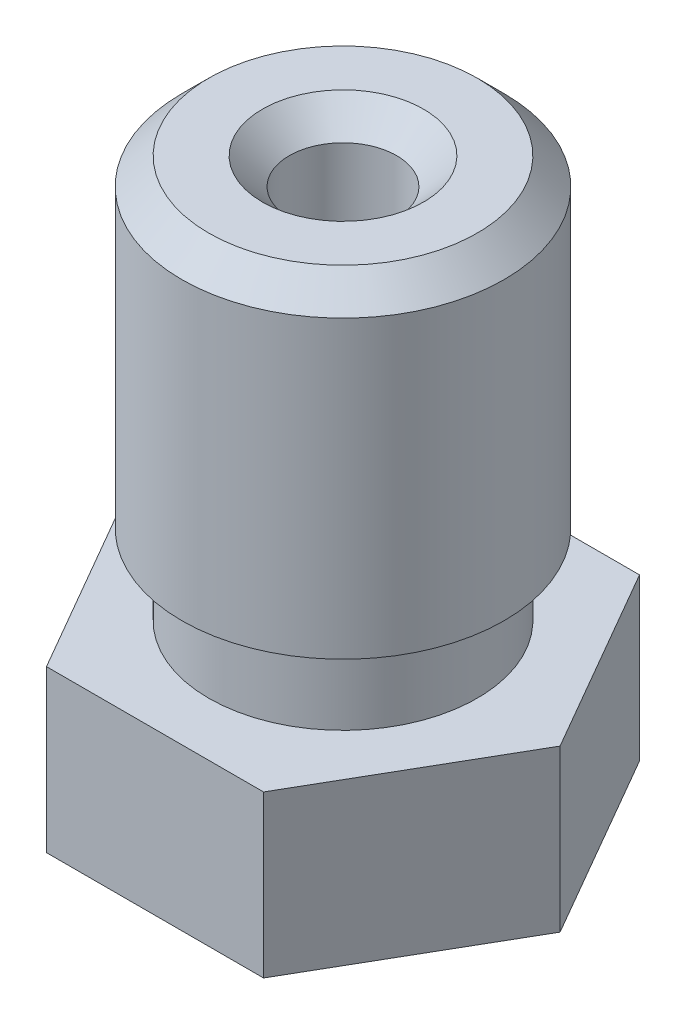
ISO-10303-21;
HEADER;
FILE_DESCRIPTION(('STEP AP214'),'2;1');
FILE_NAME('part.step','',(''),(''),'','','');
FILE_SCHEMA(('AUTOMOTIVE_DESIGN { 1 0 10303 214 1 1 1 1 }'));
ENDSEC;
DATA;
#1=APPLICATION_CONTEXT('core data for automotive mechanical design processes');
#2=APPLICATION_PROTOCOL_DEFINITION('international standard','automotive_design',2000,#1);
#3=PRODUCT_CONTEXT('',#1,'mechanical');
#4=PRODUCT('Part','Part','',(#3));
#5=PRODUCT_RELATED_PRODUCT_CATEGORY('part','',(#4));
#6=PRODUCT_DEFINITION_FORMATION('','',#4);
#7=PRODUCT_DEFINITION_CONTEXT('part definition',#1,'design');
#8=PRODUCT_DEFINITION('design','',#6,#7);
#9=PRODUCT_DEFINITION_SHAPE('','',#8);
#10=(LENGTH_UNIT() NAMED_UNIT(*) SI_UNIT(.MILLI.,.METRE.));
#11=(NAMED_UNIT(*) PLANE_ANGLE_UNIT() SI_UNIT($,.RADIAN.));
#12=(NAMED_UNIT(*) SI_UNIT($,.STERADIAN.) SOLID_ANGLE_UNIT());
#13=UNCERTAINTY_MEASURE_WITH_UNIT(LENGTH_MEASURE(1.E-05),#10,'distance_accuracy_value','');
#14=(GEOMETRIC_REPRESENTATION_CONTEXT(3) GLOBAL_UNCERTAINTY_ASSIGNED_CONTEXT((#13)) GLOBAL_UNIT_ASSIGNED_CONTEXT((#10,
#11,#12)) REPRESENTATION_CONTEXT('',''));
#15=CARTESIAN_POINT('',(0.,0.,0.));
#16=DIRECTION('',(0.,0.,1.));
#17=DIRECTION('',(1.,0.,0.));
#18=AXIS2_PLACEMENT_3D('',#15,#16,#17);
#19=CARTESIAN_POINT('',(-2.02072594216369,3.,-3.5));
#20=DIRECTION('',(0.,0.,-1.));
#21=DIRECTION('',(-1.,0.,0.));
#22=AXIS2_PLACEMENT_3D('',#19,#20,#21);
#23=PLANE('',#22);
#24=DIRECTION('',(1.,0.,0.));
#25=VECTOR('',#24,1.);
#26=CARTESIAN_POINT('',(-2.02072594216369,0.,-3.5));
#27=LINE('',#26,#25);
#28=CARTESIAN_POINT('',(-2.02072594216369,0.,-3.5));
#29=VERTEX_POINT('',#28);
#30=CARTESIAN_POINT('',(2.02072594216369,0.,-3.5));
#31=VERTEX_POINT('',#30);
#32=EDGE_CURVE('E120',#29,#31,#27,.T.);
#33=ORIENTED_EDGE('',*,*,#32,.F.);
#34=DIRECTION('',(0.,-1.,0.));
#35=VECTOR('',#34,1.);
#36=CARTESIAN_POINT('',(-2.02072594216369,3.,-3.5));
#37=LINE('',#36,#35);
#38=CARTESIAN_POINT('',(-2.02072594216369,3.,-3.5));
#39=VERTEX_POINT('',#38);
#40=EDGE_CURVE('E49',#39,#29,#37,.T.);
#41=ORIENTED_EDGE('',*,*,#40,.F.);
#42=DIRECTION('',(1.,0.,0.));
#43=VECTOR('',#42,1.);
#44=CARTESIAN_POINT('',(-2.02072594216369,3.,-3.5));
#45=LINE('',#44,#43);
#46=CARTESIAN_POINT('',(2.02072594216369,3.,-3.5));
#47=VERTEX_POINT('',#46);
#48=EDGE_CURVE('E136',#39,#47,#45,.T.);
#49=ORIENTED_EDGE('',*,*,#48,.T.);
#50=DIRECTION('',(0.,-1.,0.));
#51=VECTOR('',#50,1.);
#52=CARTESIAN_POINT('',(2.02072594216369,3.,-3.5));
#53=LINE('',#52,#51);
#54=EDGE_CURVE('E84',#47,#31,#53,.T.);
#55=ORIENTED_EDGE('',*,*,#54,.T.);
#56=EDGE_LOOP('',(#33,#41,#49,#55));
#57=FACE_BOUND('',#56,.T.);
#58=ADVANCED_FACE('F32',(#57),#23,.T.);
#59=CARTESIAN_POINT('',(-4.04145188432738,3.,0.));
#60=DIRECTION('',(-0.866025403784439,0.,-0.5));
#61=DIRECTION('',(-0.5,0.,0.866025403784439));
#62=AXIS2_PLACEMENT_3D('',#59,#60,#61);
#63=PLANE('',#62);
#64=DIRECTION('',(0.5,0.,-0.866025403784439));
#65=VECTOR('',#64,1.);
#66=CARTESIAN_POINT('',(-4.04145188432738,0.,0.));
#67=LINE('',#66,#65);
#68=CARTESIAN_POINT('',(-4.04145188432738,0.,0.));
#69=VERTEX_POINT('',#68);
#70=EDGE_CURVE('E133',#69,#29,#67,.T.);
#71=ORIENTED_EDGE('',*,*,#70,.F.);
#72=DIRECTION('',(0.,-1.,0.));
#73=VECTOR('',#72,1.);
#74=CARTESIAN_POINT('',(-4.04145188432738,3.,0.));
#75=LINE('',#74,#73);
#76=CARTESIAN_POINT('',(-4.04145188432738,3.,0.));
#77=VERTEX_POINT('',#76);
#78=EDGE_CURVE('E72',#77,#69,#75,.T.);
#79=ORIENTED_EDGE('',*,*,#78,.F.);
#80=DIRECTION('',(0.5,0.,-0.866025403784439));
#81=VECTOR('',#80,1.);
#82=CARTESIAN_POINT('',(-4.04145188432738,3.,0.));
#83=LINE('',#82,#81);
#84=EDGE_CURVE('E110',#77,#39,#83,.T.);
#85=ORIENTED_EDGE('',*,*,#84,.T.);
#86=ORIENTED_EDGE('',*,*,#40,.T.);
#87=EDGE_LOOP('',(#71,#79,#85,#86));
#88=FACE_BOUND('',#87,.T.);
#89=ADVANCED_FACE('F209',(#88),#63,.T.);
#90=CARTESIAN_POINT('',(-2.02072594216369,3.,3.5));
#91=DIRECTION('',(-0.866025403784439,0.,0.5));
#92=DIRECTION('',(0.5,0.,0.866025403784439));
#93=AXIS2_PLACEMENT_3D('',#90,#91,#92);
#94=PLANE('',#93);
#95=DIRECTION('',(-0.5,0.,-0.866025403784438));
#96=VECTOR('',#95,1.);
#97=CARTESIAN_POINT('',(-2.02072594216369,0.,3.5));
#98=LINE('',#97,#96);
#99=CARTESIAN_POINT('',(-2.02072594216369,0.,3.5));
#100=VERTEX_POINT('',#99);
#101=EDGE_CURVE('E97',#100,#69,#98,.T.);
#102=ORIENTED_EDGE('',*,*,#101,.F.);
#103=DIRECTION('',(0.,-1.,0.));
#104=VECTOR('',#103,1.);
#105=CARTESIAN_POINT('',(-2.02072594216369,3.,3.5));
#106=LINE('',#105,#104);
#107=CARTESIAN_POINT('',(-2.02072594216369,3.,3.5));
#108=VERTEX_POINT('',#107);
#109=EDGE_CURVE('E92',#108,#100,#106,.T.);
#110=ORIENTED_EDGE('',*,*,#109,.F.);
#111=DIRECTION('',(-0.5,0.,-0.866025403784438));
#112=VECTOR('',#111,1.);
#113=CARTESIAN_POINT('',(-2.02072594216369,3.,3.5));
#114=LINE('',#113,#112);
#115=EDGE_CURVE('E95',#108,#77,#114,.T.);
#116=ORIENTED_EDGE('',*,*,#115,.T.);
#117=ORIENTED_EDGE('',*,*,#78,.T.);
#118=EDGE_LOOP('',(#102,#110,#116,#117));
#119=FACE_BOUND('',#118,.T.);
#120=ADVANCED_FACE('F94',(#119),#94,.T.);
#121=CARTESIAN_POINT('',(2.02072594216369,3.,3.5));
#122=DIRECTION('',(0.,0.,1.));
#123=DIRECTION('',(1.,0.,0.));
#124=AXIS2_PLACEMENT_3D('',#121,#122,#123);
#125=PLANE('',#124);
#126=DIRECTION('',(-1.,0.,0.));
#127=VECTOR('',#126,1.);
#128=CARTESIAN_POINT('',(2.02072594216369,0.,3.5));
#129=LINE('',#128,#127);
#130=CARTESIAN_POINT('',(2.02072594216369,0.,3.5));
#131=VERTEX_POINT('',#130);
#132=EDGE_CURVE('E130',#131,#100,#129,.T.);
#133=ORIENTED_EDGE('',*,*,#132,.F.);
#134=DIRECTION('',(0.,-1.,0.));
#135=VECTOR('',#134,1.);
#136=CARTESIAN_POINT('',(2.02072594216369,3.,3.5));
#137=LINE('',#136,#135);
#138=CARTESIAN_POINT('',(2.02072594216369,3.,3.5));
#139=VERTEX_POINT('',#138);
#140=EDGE_CURVE('E102',#139,#131,#137,.T.);
#141=ORIENTED_EDGE('',*,*,#140,.F.);
#142=DIRECTION('',(-1.,0.,0.));
#143=VECTOR('',#142,1.);
#144=CARTESIAN_POINT('',(2.02072594216369,3.,3.5));
#145=LINE('',#144,#143);
#146=EDGE_CURVE('E108',#139,#108,#145,.T.);
#147=ORIENTED_EDGE('',*,*,#146,.T.);
#148=ORIENTED_EDGE('',*,*,#109,.T.);
#149=EDGE_LOOP('',(#133,#141,#147,#148));
#150=FACE_BOUND('',#149,.T.);
#151=ADVANCED_FACE('F112',(#150),#125,.T.);
#152=CARTESIAN_POINT('',(4.04145188432738,3.,0.));
#153=DIRECTION('',(0.866025403784439,0.,0.5));
#154=DIRECTION('',(0.5,0.,-0.866025403784439));
#155=AXIS2_PLACEMENT_3D('',#152,#153,#154);
#156=PLANE('',#155);
#157=DIRECTION('',(-0.5,0.,0.866025403784439));
#158=VECTOR('',#157,1.);
#159=CARTESIAN_POINT('',(4.04145188432738,0.,0.));
#160=LINE('',#159,#158);
#161=CARTESIAN_POINT('',(4.04145188432738,0.,0.));
#162=VERTEX_POINT('',#161);
#163=EDGE_CURVE('E127',#162,#131,#160,.T.);
#164=ORIENTED_EDGE('',*,*,#163,.F.);
#165=DIRECTION('',(0.,-1.,0.));
#166=VECTOR('',#165,1.);
#167=CARTESIAN_POINT('',(4.04145188432738,3.,0.));
#168=LINE('',#167,#166);
#169=CARTESIAN_POINT('',(4.04145188432738,3.,0.));
#170=VERTEX_POINT('',#169);
#171=EDGE_CURVE('E141',#170,#162,#168,.T.);
#172=ORIENTED_EDGE('',*,*,#171,.F.);
#173=DIRECTION('',(-0.5,0.,0.866025403784439));
#174=VECTOR('',#173,1.);
#175=CARTESIAN_POINT('',(4.04145188432738,3.,0.));
#176=LINE('',#175,#174);
#177=EDGE_CURVE('E113',#170,#139,#176,.T.);
#178=ORIENTED_EDGE('',*,*,#177,.T.);
#179=ORIENTED_EDGE('',*,*,#140,.T.);
#180=EDGE_LOOP('',(#164,#172,#178,#179));
#181=FACE_BOUND('',#180,.T.);
#182=ADVANCED_FACE('F223',(#181),#156,.T.);
#183=CARTESIAN_POINT('',(2.02072594216369,3.,-3.5));
#184=DIRECTION('',(0.866025403784439,0.,-0.5));
#185=DIRECTION('',(-0.5,0.,-0.866025403784439));
#186=AXIS2_PLACEMENT_3D('',#183,#184,#185);
#187=PLANE('',#186);
#188=DIRECTION('',(0.5,0.,0.866025403784438));
#189=VECTOR('',#188,1.);
#190=CARTESIAN_POINT('',(2.02072594216369,0.,-3.5));
#191=LINE('',#190,#189);
#192=EDGE_CURVE('E123',#31,#162,#191,.T.);
#193=ORIENTED_EDGE('',*,*,#192,.F.);
#194=ORIENTED_EDGE('',*,*,#54,.F.);
#195=DIRECTION('',(0.5,0.,0.866025403784438));
#196=VECTOR('',#195,1.);
#197=CARTESIAN_POINT('',(2.02072594216369,3.,-3.5));
#198=LINE('',#197,#196);
#199=EDGE_CURVE('E115',#47,#170,#198,.T.);
#200=ORIENTED_EDGE('',*,*,#199,.T.);
#201=ORIENTED_EDGE('',*,*,#171,.T.);
#202=EDGE_LOOP('',(#193,#194,#200,#201));
#203=FACE_BOUND('',#202,.T.);
#204=ADVANCED_FACE('F205',(#203),#187,.T.);
#205=CARTESIAN_POINT('',(0.,3.,0.));
#206=DIRECTION('',(0.,-1.,0.));
#207=DIRECTION('',(0.,0.,-1.));
#208=AXIS2_PLACEMENT_3D('',#205,#206,#207);
#209=PLANE('',#208);
#210=CARTESIAN_POINT('',(0.,3.,0.));
#211=DIRECTION('',(0.,1.,0.));
#212=DIRECTION('',(0.,0.,1.));
#213=AXIS2_PLACEMENT_3D('',#210,#211,#212);
#214=CIRCLE('',#213,2.5);
#215=CARTESIAN_POINT('',(0.,3.,2.5));
#216=VERTEX_POINT('',#215);
#217=EDGE_CURVE('E138',#216,#216,#214,.T.);
#218=ORIENTED_EDGE('',*,*,#217,.F.);
#219=EDGE_LOOP('',(#218));
#220=FACE_BOUND('',#219,.T.);
#221=ORIENTED_EDGE('',*,*,#48,.F.);
#222=ORIENTED_EDGE('',*,*,#84,.F.);
#223=ORIENTED_EDGE('',*,*,#115,.F.);
#224=ORIENTED_EDGE('',*,*,#146,.F.);
#225=ORIENTED_EDGE('',*,*,#177,.F.);
#226=ORIENTED_EDGE('',*,*,#199,.F.);
#227=EDGE_LOOP('',(#221,#222,#223,#224,#225,#226));
#228=FACE_BOUND('',#227,.T.);
#229=ADVANCED_FACE('F106',(#220,#228),#209,.F.);
#230=CARTESIAN_POINT('',(0.,0.,0.));
#231=DIRECTION('',(0.,-1.,0.));
#232=DIRECTION('',(0.,0.,-1.));
#233=AXIS2_PLACEMENT_3D('',#230,#231,#232);
#234=PLANE('',#233);
#235=CARTESIAN_POINT('',(0.,-4.7295228202692E-11,0.));
#236=DIRECTION('',(0.,-1.,0.));
#237=DIRECTION('',(1.,0.,0.));
#238=AXIS2_PLACEMENT_3D('',#235,#236,#237);
#239=CIRCLE('',#238,2.49999999999773);
#240=CARTESIAN_POINT('',(2.49999999999773,-4.72946861016057E-11,0.));
#241=VERTEX_POINT('',#240);
#242=EDGE_CURVE('E148',#241,#241,#239,.T.);
#243=ORIENTED_EDGE('',*,*,#242,.F.);
#244=EDGE_LOOP('',(#243));
#245=FACE_BOUND('',#244,.T.);
#246=ORIENTED_EDGE('',*,*,#32,.T.);
#247=ORIENTED_EDGE('',*,*,#192,.T.);
#248=ORIENTED_EDGE('',*,*,#163,.T.);
#249=ORIENTED_EDGE('',*,*,#132,.T.);
#250=ORIENTED_EDGE('',*,*,#101,.T.);
#251=ORIENTED_EDGE('',*,*,#70,.T.);
#252=EDGE_LOOP('',(#246,#247,#248,#249,#250,#251));
#253=FACE_BOUND('',#252,.T.);
#254=ADVANCED_FACE('F208',(#245,#253),#234,.T.);
#255=CARTESIAN_POINT('',(0.,3.,0.));
#256=DIRECTION('',(0.,1.,0.));
#257=DIRECTION('',(0.,0.,1.));
#258=AXIS2_PLACEMENT_3D('',#255,#256,#257);
#259=CYLINDRICAL_SURFACE('',#258,2.5);
#260=ORIENTED_EDGE('',*,*,#217,.T.);
#261=EDGE_LOOP('',(#260));
#262=FACE_BOUND('',#261,.T.);
#263=CARTESIAN_POINT('',(0.,4.5,0.));
#264=DIRECTION('',(0.,1.,0.));
#265=DIRECTION('',(0.,0.,1.));
#266=AXIS2_PLACEMENT_3D('',#263,#264,#265);
#267=CIRCLE('',#266,2.5);
#268=CARTESIAN_POINT('',(0.,4.5,2.5));
#269=VERTEX_POINT('',#268);
#270=EDGE_CURVE('E196',#269,#269,#267,.T.);
#271=ORIENTED_EDGE('',*,*,#270,.F.);
#272=EDGE_LOOP('',(#271));
#273=FACE_BOUND('',#272,.T.);
#274=ADVANCED_FACE('F165',(#262,#273),#259,.T.);
#275=CARTESIAN_POINT('',(0.,10.5,0.));
#276=DIRECTION('',(0.,1.,0.));
#277=DIRECTION('',(0.,0.,1.));
#278=AXIS2_PLACEMENT_3D('',#275,#276,#277);
#279=PLANE('',#278);
#280=CARTESIAN_POINT('',(0.,10.5,0.));
#281=DIRECTION('',(0.,1.,0.));
#282=DIRECTION('',(0.,0.,1.));
#283=AXIS2_PLACEMENT_3D('',#280,#281,#282);
#284=CIRCLE('',#283,2.49999999995498);
#285=CARTESIAN_POINT('',(0.,10.5,2.49999999995498));
#286=VERTEX_POINT('',#285);
#287=EDGE_CURVE('E147',#286,#286,#284,.T.);
#288=ORIENTED_EDGE('',*,*,#287,.T.);
#289=EDGE_LOOP('',(#288));
#290=FACE_BOUND('',#289,.T.);
#291=CARTESIAN_POINT('',(0.,10.5,0.));
#292=DIRECTION('',(0.,1.,0.));
#293=DIRECTION('',(0.,0.,1.));
#294=AXIS2_PLACEMENT_3D('',#291,#292,#293);
#295=CIRCLE('',#294,1.50000000001028);
#296=CARTESIAN_POINT('',(0.,10.5,1.50000000001028));
#297=VERTEX_POINT('',#296);
#298=EDGE_CURVE('E144',#297,#297,#295,.F.);
#299=ORIENTED_EDGE('',*,*,#298,.T.);
#300=EDGE_LOOP('',(#299));
#301=FACE_BOUND('',#300,.T.);
#302=ADVANCED_FACE('F162',(#290,#301),#279,.T.);
#303=CARTESIAN_POINT('',(0.,3.,0.));
#304=DIRECTION('',(0.,1.,0.));
#305=DIRECTION('',(0.,0.,1.));
#306=AXIS2_PLACEMENT_3D('',#303,#304,#305);
#307=CYLINDRICAL_SURFACE('',#306,3.);
#308=CARTESIAN_POINT('',(0.,10.0000000000118,0.));
#309=DIRECTION('',(0.,1.,0.));
#310=DIRECTION('',(0.,0.,1.));
#311=AXIS2_PLACEMENT_3D('',#308,#309,#310);
#312=CIRCLE('',#311,3.);
#313=CARTESIAN_POINT('',(0.,10.0000000000118,3.));
#314=VERTEX_POINT('',#313);
#315=EDGE_CURVE('E41',#314,#314,#312,.F.);
#316=ORIENTED_EDGE('',*,*,#315,.T.);
#317=EDGE_LOOP('',(#316));
#318=FACE_BOUND('',#317,.T.);
#319=CARTESIAN_POINT('',(0.,4.5,0.));
#320=DIRECTION('',(0.,1.,0.));
#321=DIRECTION('',(0.,0.,1.));
#322=AXIS2_PLACEMENT_3D('',#319,#320,#321);
#323=CIRCLE('',#322,3.);
#324=CARTESIAN_POINT('',(0.,4.5,3.));
#325=VERTEX_POINT('',#324);
#326=EDGE_CURVE('E124',#325,#325,#323,.T.);
#327=ORIENTED_EDGE('',*,*,#326,.T.);
#328=EDGE_LOOP('',(#327));
#329=FACE_BOUND('',#328,.T.);
#330=ADVANCED_FACE('F153',(#318,#329),#307,.T.);
#331=CARTESIAN_POINT('',(3.,4.5,0.));
#332=DIRECTION('',(0.,-1.,0.));
#333=DIRECTION('',(0.,0.,-1.));
#334=AXIS2_PLACEMENT_3D('',#331,#332,#333);
#335=PLANE('',#334);
#336=ORIENTED_EDGE('',*,*,#270,.T.);
#337=EDGE_LOOP('',(#336));
#338=FACE_BOUND('',#337,.T.);
#339=ORIENTED_EDGE('',*,*,#326,.F.);
#340=EDGE_LOOP('',(#339));
#341=FACE_BOUND('',#340,.T.);
#342=ADVANCED_FACE('F243',(#338,#341),#335,.T.);
#343=CARTESIAN_POINT('',(0.,-2.,0.));
#344=DIRECTION('',(0.,1.,0.));
#345=DIRECTION('',(-1.,0.,0.));
#346=AXIS2_PLACEMENT_3D('',#343,#344,#345);
#347=CONICAL_SURFACE('',#346,0.50000000004502,0.785398163397449);
#348=ORIENTED_EDGE('',*,*,#242,.T.);
#349=EDGE_LOOP('',(#348));
#350=FACE_BOUND('',#349,.T.);
#351=CARTESIAN_POINT('',(0.,-2.,0.));
#352=DIRECTION('',(0.,-1.,0.));
#353=DIRECTION('',(1.,0.,0.));
#354=AXIS2_PLACEMENT_3D('',#351,#352,#353);
#355=CIRCLE('',#354,0.50000000004502);
#356=CARTESIAN_POINT('',(0.50000000004502,-2.,0.));
#357=VERTEX_POINT('',#356);
#358=EDGE_CURVE('E187',#357,#357,#355,.T.);
#359=ORIENTED_EDGE('',*,*,#358,.F.);
#360=EDGE_LOOP('',(#359));
#361=FACE_BOUND('',#360,.T.);
#362=ADVANCED_FACE('F246',(#350,#361),#347,.T.);
#363=CARTESIAN_POINT('',(0.,-2.,0.));
#364=DIRECTION('',(0.,-1.,0.));
#365=DIRECTION('',(1.,0.,0.));
#366=AXIS2_PLACEMENT_3D('',#363,#364,#365);
#367=PLANE('',#366);
#368=CARTESIAN_POINT('',(0.,-2.,0.));
#369=DIRECTION('',(0.,1.,0.));
#370=DIRECTION('',(0.,0.,1.));
#371=AXIS2_PLACEMENT_3D('',#368,#369,#370);
#372=CIRCLE('',#371,0.2);
#373=CARTESIAN_POINT('',(0.,-2.,0.2));
#374=VERTEX_POINT('',#373);
#375=EDGE_CURVE('E183',#374,#374,#372,.T.);
#376=ORIENTED_EDGE('',*,*,#375,.T.);
#377=EDGE_LOOP('',(#376));
#378=FACE_BOUND('',#377,.T.);
#379=ORIENTED_EDGE('',*,*,#358,.T.);
#380=EDGE_LOOP('',(#379));
#381=FACE_BOUND('',#380,.T.);
#382=ADVANCED_FACE('F250',(#378,#381),#367,.T.);
#383=CARTESIAN_POINT('',(0.,-2.,0.));
#384=DIRECTION('',(0.,1.,0.));
#385=DIRECTION('',(0.,0.,1.));
#386=AXIS2_PLACEMENT_3D('',#383,#384,#385);
#387=CYLINDRICAL_SURFACE('',#386,0.2);
#388=ORIENTED_EDGE('',*,*,#375,.F.);
#389=EDGE_LOOP('',(#388));
#390=FACE_BOUND('',#389,.T.);
#391=CARTESIAN_POINT('',(0.,-1.20000000003984,0.));
#392=DIRECTION('',(0.,1.,0.));
#393=DIRECTION('',(0.,0.,1.));
#394=AXIS2_PLACEMENT_3D('',#391,#392,#393);
#395=CIRCLE('',#394,0.2);
#396=CARTESIAN_POINT('',(0.,-1.20000000003984,0.2));
#397=VERTEX_POINT('',#396);
#398=EDGE_CURVE('E272',#397,#397,#395,.T.);
#399=ORIENTED_EDGE('',*,*,#398,.T.);
#400=EDGE_LOOP('',(#399));
#401=FACE_BOUND('',#400,.T.);
#402=ADVANCED_FACE('F177',(#390,#401),#387,.F.);
#403=CARTESIAN_POINT('',(0.,-2.,0.));
#404=DIRECTION('',(0.,1.,0.));
#405=DIRECTION('',(0.,0.,1.));
#406=AXIS2_PLACEMENT_3D('',#403,#404,#405);
#407=CYLINDRICAL_SURFACE('',#406,1.0000000000221);
#408=CARTESIAN_POINT('',(0.,9.99999999995498,0.));
#409=DIRECTION('',(0.,1.,0.));
#410=DIRECTION('',(0.,0.,1.));
#411=AXIS2_PLACEMENT_3D('',#408,#409,#410);
#412=CIRCLE('',#411,1.0000000000221);
#413=CARTESIAN_POINT('',(0.,9.99999999995498,1.0000000000221));
#414=VERTEX_POINT('',#413);
#415=EDGE_CURVE('E11',#414,#414,#412,.T.);
#416=ORIENTED_EDGE('',*,*,#415,.T.);
#417=EDGE_LOOP('',(#416));
#418=FACE_BOUND('',#417,.T.);
#419=CARTESIAN_POINT('',(0.,-5.16756776258731E-11,0.));
#420=DIRECTION('',(0.,1.,0.));
#421=DIRECTION('',(0.,0.,1.));
#422=AXIS2_PLACEMENT_3D('',#419,#420,#421);
#423=CIRCLE('',#422,1.0000000000221);
#424=CARTESIAN_POINT('',(0.,-5.16756776258731E-11,1.0000000000221));
#425=VERTEX_POINT('',#424);
#426=EDGE_CURVE('E181',#425,#425,#423,.T.);
#427=ORIENTED_EDGE('',*,*,#426,.F.);
#428=EDGE_LOOP('',(#427));
#429=FACE_BOUND('',#428,.T.);
#430=ADVANCED_FACE('F173',(#418,#429),#407,.F.);
#431=CARTESIAN_POINT('',(0.,-5.16756776258731E-11,0.));
#432=DIRECTION('',(0.,1.,0.));
#433=DIRECTION('',(0.,0.,1.));
#434=AXIS2_PLACEMENT_3D('',#431,#432,#433);
#435=CONICAL_SURFACE('',#434,1.0000000000221,0.832981266867366);
#436=CARTESIAN_POINT('',(0.,-0.227272727272521,0.));
#437=DIRECTION('',(0.,1.,0.));
#438=DIRECTION('',(0.,0.,1.));
#439=AXIS2_PLACEMENT_3D('',#436,#437,#438);
#440=CIRCLE('',#439,0.749999999982265);
#441=CARTESIAN_POINT('',(0.,-0.227272727272521,0.749999999982265));
#442=VERTEX_POINT('',#441);
#443=EDGE_CURVE('E184',#442,#442,#440,.T.);
#444=ORIENTED_EDGE('',*,*,#443,.F.);
#445=EDGE_LOOP('',(#444));
#446=FACE_BOUND('',#445,.T.);
#447=ORIENTED_EDGE('',*,*,#426,.T.);
#448=EDGE_LOOP('',(#447));
#449=FACE_BOUND('',#448,.T.);
#450=ADVANCED_FACE('F176',(#446,#449),#435,.F.);
#451=CARTESIAN_POINT('',(0.,-2.,0.));
#452=DIRECTION('',(0.,1.,0.));
#453=DIRECTION('',(0.,0.,1.));
#454=AXIS2_PLACEMENT_3D('',#451,#452,#453);
#455=CYLINDRICAL_SURFACE('',#454,0.749999999982265);
#456=CARTESIAN_POINT('',(0.,-0.700000000051659,0.));
#457=DIRECTION('',(0.,1.,0.));
#458=DIRECTION('',(0.,0.,1.));
#459=AXIS2_PLACEMENT_3D('',#456,#457,#458);
#460=CIRCLE('',#459,0.749999999982265);
#461=CARTESIAN_POINT('',(0.,-0.700000000051659,0.749999999982265));
#462=VERTEX_POINT('',#461);
#463=EDGE_CURVE('E190',#462,#462,#460,.T.);
#464=ORIENTED_EDGE('',*,*,#463,.F.);
#465=EDGE_LOOP('',(#464));
#466=FACE_BOUND('',#465,.T.);
#467=ORIENTED_EDGE('',*,*,#443,.T.);
#468=EDGE_LOOP('',(#467));
#469=FACE_BOUND('',#468,.T.);
#470=ADVANCED_FACE('F260',(#466,#469),#455,.F.);
#471=CARTESIAN_POINT('',(0.,-0.700000000051659,0.));
#472=DIRECTION('',(0.,1.,0.));
#473=DIRECTION('',(0.,0.,1.));
#474=AXIS2_PLACEMENT_3D('',#471,#472,#473);
#475=CONICAL_SURFACE('',#474,0.749999999982265,0.832981266670152);
#476=ORIENTED_EDGE('',*,*,#398,.F.);
#477=EDGE_LOOP('',(#476));
#478=FACE_BOUND('',#477,.T.);
#479=ORIENTED_EDGE('',*,*,#463,.T.);
#480=EDGE_LOOP('',(#479));
#481=FACE_BOUND('',#480,.T.);
#482=ADVANCED_FACE('F159',(#478,#481),#475,.F.);
#483=CARTESIAN_POINT('',(0.,10.5,0.));
#484=DIRECTION('',(0.,-1.,0.));
#485=DIRECTION('',(0.,0.,-1.));
#486=AXIS2_PLACEMENT_3D('',#483,#484,#485);
#487=CONICAL_SURFACE('',#486,2.49999999995498,0.785398163454287);
#488=ORIENTED_EDGE('',*,*,#315,.F.);
#489=EDGE_LOOP('',(#488));
#490=FACE_BOUND('',#489,.T.);
#491=ORIENTED_EDGE('',*,*,#287,.F.);
#492=EDGE_LOOP('',(#491));
#493=FACE_BOUND('',#492,.T.);
#494=ADVANCED_FACE('F156',(#490,#493),#487,.T.);
#495=CARTESIAN_POINT('',(0.,9.99999999995498,0.));
#496=DIRECTION('',(0.,1.,0.));
#497=DIRECTION('',(0.,0.,1.));
#498=AXIS2_PLACEMENT_3D('',#495,#496,#497);
#499=CONICAL_SURFACE('',#498,1.0000000000221,0.785398163340609);
#500=ORIENTED_EDGE('',*,*,#298,.F.);
#501=EDGE_LOOP('',(#500));
#502=FACE_BOUND('',#501,.T.);
#503=ORIENTED_EDGE('',*,*,#415,.F.);
#504=EDGE_LOOP('',(#503));
#505=FACE_BOUND('',#504,.T.);
#506=ADVANCED_FACE('F34',(#502,#505),#499,.F.);
#507=CLOSED_SHELL('',(#58,#89,#120,#151,#182,#204,#229,#254,#274,#302,#330,#342,#362,#382,#402,
#430,#450,#470,#482,#494,#506));
#508=MANIFOLD_SOLID_BREP('B2',#507);
#509=ADVANCED_BREP_SHAPE_REPRESENTATION('',(#18,#508),#14);
#510=SHAPE_DEFINITION_REPRESENTATION(#9,#509);
ENDSEC;
END-ISO-10303-21;
